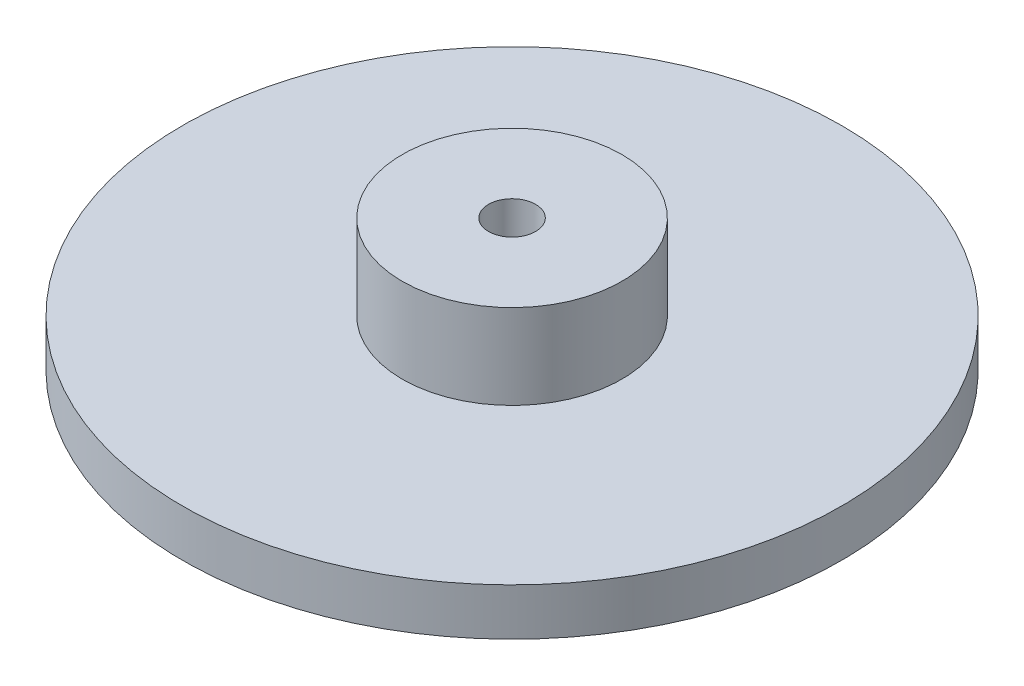
ISO-10303-21;
HEADER;
FILE_DESCRIPTION(('STEP AP214'),'2;1');
FILE_NAME('part.step','',(''),(''),'','','');
FILE_SCHEMA(('AUTOMOTIVE_DESIGN { 1 0 10303 214 1 1 1 1 }'));
ENDSEC;
DATA;
#1=APPLICATION_CONTEXT('core data for automotive mechanical design processes');
#2=APPLICATION_PROTOCOL_DEFINITION('international standard','automotive_design',2000,#1);
#3=PRODUCT_CONTEXT('',#1,'mechanical');
#4=PRODUCT('Part','Part','',(#3));
#5=PRODUCT_RELATED_PRODUCT_CATEGORY('part','',(#4));
#6=PRODUCT_DEFINITION_FORMATION('','',#4);
#7=PRODUCT_DEFINITION_CONTEXT('part definition',#1,'design');
#8=PRODUCT_DEFINITION('design','',#6,#7);
#9=PRODUCT_DEFINITION_SHAPE('','',#8);
#10=(LENGTH_UNIT() NAMED_UNIT(*) SI_UNIT(.MILLI.,.METRE.));
#11=(NAMED_UNIT(*) PLANE_ANGLE_UNIT() SI_UNIT($,.RADIAN.));
#12=(NAMED_UNIT(*) SI_UNIT($,.STERADIAN.) SOLID_ANGLE_UNIT());
#13=UNCERTAINTY_MEASURE_WITH_UNIT(LENGTH_MEASURE(1.E-05),#10,'distance_accuracy_value','');
#14=(GEOMETRIC_REPRESENTATION_CONTEXT(3) GLOBAL_UNCERTAINTY_ASSIGNED_CONTEXT((#13)) GLOBAL_UNIT_ASSIGNED_CONTEXT((#10,
#11,#12)) REPRESENTATION_CONTEXT('',''));
#15=CARTESIAN_POINT('',(0.,0.,0.));
#16=DIRECTION('',(0.,0.,1.));
#17=DIRECTION('',(1.,0.,0.));
#18=AXIS2_PLACEMENT_3D('',#15,#16,#17);
#19=CARTESIAN_POINT('',(21.,0.,0.));
#20=DIRECTION('',(0.,-1.,0.));
#21=DIRECTION('',(0.,0.,-1.));
#22=AXIS2_PLACEMENT_3D('',#19,#20,#21);
#23=PLANE('',#22);
#24=CARTESIAN_POINT('',(0.,0.,0.));
#25=DIRECTION('',(0.,1.,0.));
#26=DIRECTION('',(0.,0.,1.));
#27=AXIS2_PLACEMENT_3D('',#24,#25,#26);
#28=CIRCLE('',#27,1.5);
#29=CARTESIAN_POINT('',(0.,0.,1.5));
#30=VERTEX_POINT('',#29);
#31=EDGE_CURVE('E50',#30,#30,#28,.T.);
#32=ORIENTED_EDGE('',*,*,#31,.T.);
#33=EDGE_LOOP('',(#32));
#34=FACE_BOUND('',#33,.T.);
#35=CARTESIAN_POINT('',(0.,0.,0.));
#36=DIRECTION('',(0.,-1.,0.));
#37=DIRECTION('',(0.,0.,-1.));
#38=AXIS2_PLACEMENT_3D('',#35,#36,#37);
#39=CIRCLE('',#38,21.);
#40=CARTESIAN_POINT('',(0.,0.,-21.));
#41=VERTEX_POINT('',#40);
#42=EDGE_CURVE('E45',#41,#41,#39,.T.);
#43=ORIENTED_EDGE('',*,*,#42,.T.);
#44=EDGE_LOOP('',(#43));
#45=FACE_BOUND('',#44,.T.);
#46=ADVANCED_FACE('F31',(#34,#45),#23,.T.);
#47=CARTESIAN_POINT('',(0.,8.4,0.));
#48=DIRECTION('',(0.,1.,0.));
#49=DIRECTION('',(0.,0.,1.));
#50=AXIS2_PLACEMENT_3D('',#47,#48,#49);
#51=PLANE('',#50);
#52=CARTESIAN_POINT('',(0.,8.4,0.));
#53=DIRECTION('',(0.,1.,0.));
#54=DIRECTION('',(0.,0.,1.));
#55=AXIS2_PLACEMENT_3D('',#52,#53,#54);
#56=CIRCLE('',#55,1.5);
#57=CARTESIAN_POINT('',(0.,8.4,1.5));
#58=VERTEX_POINT('',#57);
#59=EDGE_CURVE('E51',#58,#58,#56,.T.);
#60=ORIENTED_EDGE('',*,*,#59,.F.);
#61=EDGE_LOOP('',(#60));
#62=FACE_BOUND('',#61,.T.);
#63=CARTESIAN_POINT('',(0.,8.4,0.));
#64=DIRECTION('',(0.,-1.,0.));
#65=DIRECTION('',(0.,0.,-1.));
#66=AXIS2_PLACEMENT_3D('',#63,#64,#65);
#67=CIRCLE('',#66,7.);
#68=CARTESIAN_POINT('',(0.,8.4,-7.));
#69=VERTEX_POINT('',#68);
#70=EDGE_CURVE('E10',#69,#69,#67,.T.);
#71=ORIENTED_EDGE('',*,*,#70,.F.);
#72=EDGE_LOOP('',(#71));
#73=FACE_BOUND('',#72,.T.);
#74=ADVANCED_FACE('F66',(#62,#73),#51,.T.);
#75=CARTESIAN_POINT('',(0.,0.,0.));
#76=DIRECTION('',(0.,-1.,0.));
#77=DIRECTION('',(0.,0.,-1.));
#78=AXIS2_PLACEMENT_3D('',#75,#76,#77);
#79=CYLINDRICAL_SURFACE('',#78,7.);
#80=ORIENTED_EDGE('',*,*,#70,.T.);
#81=EDGE_LOOP('',(#80));
#82=FACE_BOUND('',#81,.T.);
#83=CARTESIAN_POINT('',(0.,3.,0.));
#84=DIRECTION('',(0.,-1.,0.));
#85=DIRECTION('',(0.,0.,-1.));
#86=AXIS2_PLACEMENT_3D('',#83,#84,#85);
#87=CIRCLE('',#86,7.);
#88=CARTESIAN_POINT('',(0.,3.,-7.));
#89=VERTEX_POINT('',#88);
#90=EDGE_CURVE('E37',#89,#89,#87,.T.);
#91=ORIENTED_EDGE('',*,*,#90,.F.);
#92=EDGE_LOOP('',(#91));
#93=FACE_BOUND('',#92,.T.);
#94=ADVANCED_FACE('F69',(#82,#93),#79,.T.);
#95=CARTESIAN_POINT('',(7.,3.,0.));
#96=DIRECTION('',(0.,1.,0.));
#97=DIRECTION('',(0.,0.,1.));
#98=AXIS2_PLACEMENT_3D('',#95,#96,#97);
#99=PLANE('',#98);
#100=ORIENTED_EDGE('',*,*,#90,.T.);
#101=EDGE_LOOP('',(#100));
#102=FACE_BOUND('',#101,.T.);
#103=CARTESIAN_POINT('',(0.,3.,0.));
#104=DIRECTION('',(0.,-1.,0.));
#105=DIRECTION('',(0.,0.,-1.));
#106=AXIS2_PLACEMENT_3D('',#103,#104,#105);
#107=CIRCLE('',#106,21.);
#108=CARTESIAN_POINT('',(0.,3.,-21.));
#109=VERTEX_POINT('',#108);
#110=EDGE_CURVE('E41',#109,#109,#107,.T.);
#111=ORIENTED_EDGE('',*,*,#110,.F.);
#112=EDGE_LOOP('',(#111));
#113=FACE_BOUND('',#112,.T.);
#114=ADVANCED_FACE('F74',(#102,#113),#99,.T.);
#115=CARTESIAN_POINT('',(0.,0.,0.));
#116=DIRECTION('',(0.,-1.,0.));
#117=DIRECTION('',(0.,0.,-1.));
#118=AXIS2_PLACEMENT_3D('',#115,#116,#117);
#119=CYLINDRICAL_SURFACE('',#118,21.);
#120=ORIENTED_EDGE('',*,*,#110,.T.);
#121=EDGE_LOOP('',(#120));
#122=FACE_BOUND('',#121,.T.);
#123=ORIENTED_EDGE('',*,*,#42,.F.);
#124=EDGE_LOOP('',(#123));
#125=FACE_BOUND('',#124,.T.);
#126=ADVANCED_FACE('F62',(#122,#125),#119,.T.);
#127=CARTESIAN_POINT('',(0.,0.,0.));
#128=DIRECTION('',(0.,1.,0.));
#129=DIRECTION('',(0.,0.,1.));
#130=AXIS2_PLACEMENT_3D('',#127,#128,#129);
#131=CYLINDRICAL_SURFACE('',#130,1.5);
#132=ORIENTED_EDGE('',*,*,#31,.F.);
#133=EDGE_LOOP('',(#132));
#134=FACE_BOUND('',#133,.T.);
#135=ORIENTED_EDGE('',*,*,#59,.T.);
#136=EDGE_LOOP('',(#135));
#137=FACE_BOUND('',#136,.T.);
#138=ADVANCED_FACE('F59',(#134,#137),#131,.F.);
#139=CLOSED_SHELL('',(#46,#74,#94,#114,#126,#138));
#140=MANIFOLD_SOLID_BREP('B2',#139);
#141=ADVANCED_BREP_SHAPE_REPRESENTATION('',(#18,#140),#14);
#142=SHAPE_DEFINITION_REPRESENTATION(#9,#141);
ENDSEC;
END-ISO-10303-21;
